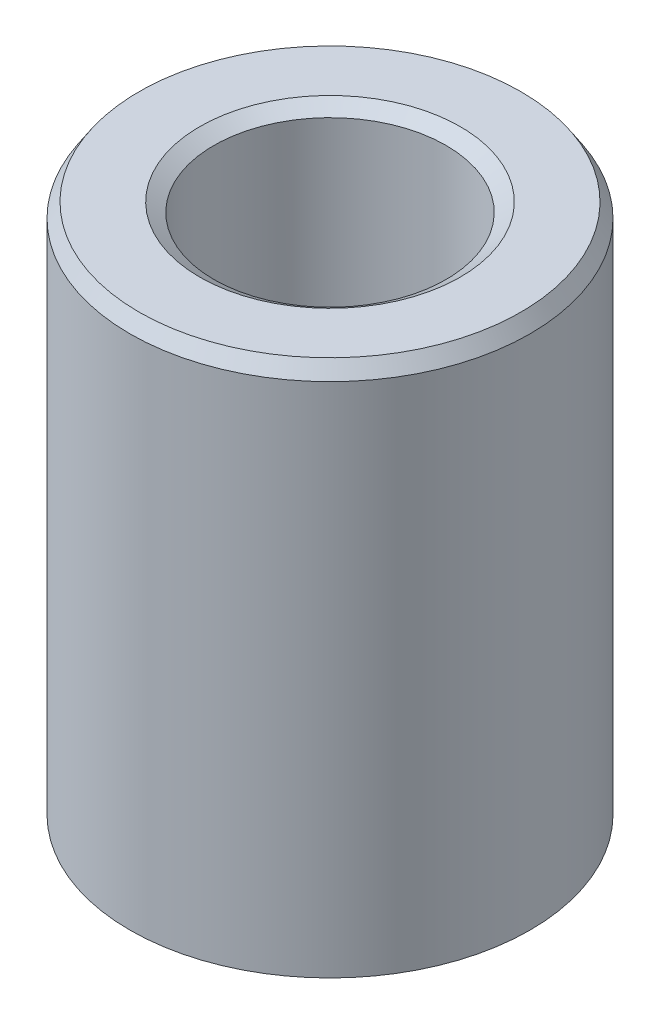
ISO-10303-21;
HEADER;
FILE_DESCRIPTION(('STEP AP214'),'2;1');
FILE_NAME('part.step','',(''),(''),'','','');
FILE_SCHEMA(('AUTOMOTIVE_DESIGN { 1 0 10303 214 1 1 1 1 }'));
ENDSEC;
DATA;
#1=APPLICATION_CONTEXT('core data for automotive mechanical design processes');
#2=APPLICATION_PROTOCOL_DEFINITION('international standard','automotive_design',2000,#1);
#3=PRODUCT_CONTEXT('',#1,'mechanical');
#4=PRODUCT('Part','Part','',(#3));
#5=PRODUCT_RELATED_PRODUCT_CATEGORY('part','',(#4));
#6=PRODUCT_DEFINITION_FORMATION('','',#4);
#7=PRODUCT_DEFINITION_CONTEXT('part definition',#1,'design');
#8=PRODUCT_DEFINITION('design','',#6,#7);
#9=PRODUCT_DEFINITION_SHAPE('','',#8);
#10=(LENGTH_UNIT() NAMED_UNIT(*) SI_UNIT(.MILLI.,.METRE.));
#11=(NAMED_UNIT(*) PLANE_ANGLE_UNIT() SI_UNIT($,.RADIAN.));
#12=(NAMED_UNIT(*) SI_UNIT($,.STERADIAN.) SOLID_ANGLE_UNIT());
#13=UNCERTAINTY_MEASURE_WITH_UNIT(LENGTH_MEASURE(1.E-05),#10,'distance_accuracy_value','');
#14=(GEOMETRIC_REPRESENTATION_CONTEXT(3) GLOBAL_UNCERTAINTY_ASSIGNED_CONTEXT((#13)) GLOBAL_UNIT_ASSIGNED_CONTEXT((#10,
#11,#12)) REPRESENTATION_CONTEXT('',''));
#15=CARTESIAN_POINT('',(0.,0.,0.));
#16=DIRECTION('',(0.,0.,1.));
#17=DIRECTION('',(1.,0.,0.));
#18=AXIS2_PLACEMENT_3D('',#15,#16,#17);
#19=CARTESIAN_POINT('',(0.,128.129675056822,0.));
#20=DIRECTION('',(0.,-1.,0.));
#21=DIRECTION('',(0.,0.,-1.));
#22=AXIS2_PLACEMENT_3D('',#19,#20,#21);
#23=CYLINDRICAL_SURFACE('',#22,47.5);
#24=CARTESIAN_POINT('',(0.,2.17447413861541,0.));
#25=DIRECTION('',(0.,1.,0.));
#26=DIRECTION('',(0.,0.,1.));
#27=AXIS2_PLACEMENT_3D('',#24,#25,#26);
#28=CIRCLE('',#27,47.5);
#29=CARTESIAN_POINT('',(0.,2.17447413861541,47.5));
#30=VERTEX_POINT('',#29);
#31=EDGE_CURVE('E10',#30,#30,#28,.T.);
#32=ORIENTED_EDGE('',*,*,#31,.T.);
#33=EDGE_LOOP('',(#32));
#34=FACE_BOUND('',#33,.T.);
#35=CARTESIAN_POINT('',(0.,124.757350152276,0.));
#36=DIRECTION('',(0.,1.,0.));
#37=DIRECTION('',(0.,0.,1.));
#38=AXIS2_PLACEMENT_3D('',#35,#36,#37);
#39=CIRCLE('',#38,47.5);
#40=CARTESIAN_POINT('',(0.,124.757350152276,47.5));
#41=VERTEX_POINT('',#40);
#42=EDGE_CURVE('E50',#41,#41,#39,.F.);
#43=ORIENTED_EDGE('',*,*,#42,.T.);
#44=EDGE_LOOP('',(#43));
#45=FACE_BOUND('',#44,.T.);
#46=ADVANCED_FACE('F39',(#34,#45),#23,.T.);
#47=CARTESIAN_POINT('',(0.,128.129675056822,0.));
#48=DIRECTION('',(0.,1.,0.));
#49=DIRECTION('',(0.,0.,1.));
#50=AXIS2_PLACEMENT_3D('',#47,#48,#49);
#51=PLANE('',#50);
#52=CARTESIAN_POINT('',(0.,128.129675056822,0.));
#53=DIRECTION('',(0.,1.,0.));
#54=DIRECTION('',(0.,0.,1.));
#55=AXIS2_PLACEMENT_3D('',#52,#53,#54);
#56=CIRCLE('',#55,30.9391969328806);
#57=CARTESIAN_POINT('',(0.,128.129675056822,30.9391969328806));
#58=VERTEX_POINT('',#57);
#59=EDGE_CURVE('E58',#58,#58,#56,.F.);
#60=ORIENTED_EDGE('',*,*,#59,.T.);
#61=EDGE_LOOP('',(#60));
#62=FACE_BOUND('',#61,.T.);
#63=CARTESIAN_POINT('',(0.,128.129675056822,0.));
#64=DIRECTION('',(0.,1.,0.));
#65=DIRECTION('',(0.,0.,1.));
#66=AXIS2_PLACEMENT_3D('',#63,#64,#65);
#67=CIRCLE('',#66,45.3255258613846);
#68=CARTESIAN_POINT('',(0.,128.129675056822,45.3255258613846));
#69=VERTEX_POINT('',#68);
#70=EDGE_CURVE('E61',#69,#69,#67,.T.);
#71=ORIENTED_EDGE('',*,*,#70,.T.);
#72=EDGE_LOOP('',(#71));
#73=FACE_BOUND('',#72,.T.);
#74=ADVANCED_FACE('F88',(#62,#73),#51,.T.);
#75=CARTESIAN_POINT('',(0.,0.,0.));
#76=DIRECTION('',(0.,1.,0.));
#77=DIRECTION('',(0.,0.,1.));
#78=AXIS2_PLACEMENT_3D('',#75,#76,#77);
#79=PLANE('',#78);
#80=CARTESIAN_POINT('',(0.,0.,0.));
#81=DIRECTION('',(0.,1.,0.));
#82=DIRECTION('',(0.,0.,1.));
#83=AXIS2_PLACEMENT_3D('',#80,#81,#82);
#84=CIRCLE('',#83,29.7413461669496);
#85=CARTESIAN_POINT('',(0.,0.,-29.7413461669496));
#86=VERTEX_POINT('',#85);
#87=EDGE_CURVE('E51',#86,#86,#84,.T.);
#88=ORIENTED_EDGE('',*,*,#87,.T.);
#89=EDGE_LOOP('',(#88));
#90=FACE_BOUND('',#89,.T.);
#91=CARTESIAN_POINT('',(0.,0.,0.));
#92=DIRECTION('',(0.,1.,0.));
#93=DIRECTION('',(0.,0.,1.));
#94=AXIS2_PLACEMENT_3D('',#91,#92,#93);
#95=CIRCLE('',#94,44.1276750954537);
#96=CARTESIAN_POINT('',(0.,0.,44.1276750954537));
#97=VERTEX_POINT('',#96);
#98=EDGE_CURVE('E54',#97,#97,#95,.F.);
#99=ORIENTED_EDGE('',*,*,#98,.T.);
#100=EDGE_LOOP('',(#99));
#101=FACE_BOUND('',#100,.T.);
#102=ADVANCED_FACE('F83',(#90,#101),#79,.F.);
#103=CARTESIAN_POINT('',(0.,128.129675056822,0.));
#104=DIRECTION('',(0.,-1.,0.));
#105=DIRECTION('',(0.,0.,-1.));
#106=AXIS2_PLACEMENT_3D('',#103,#104,#105);
#107=CYLINDRICAL_SURFACE('',#106,27.5668720283342);
#108=CARTESIAN_POINT('',(0.,125.955200918207,0.));
#109=DIRECTION('',(0.,1.,0.));
#110=DIRECTION('',(0.,0.,1.));
#111=AXIS2_PLACEMENT_3D('',#108,#109,#110);
#112=CIRCLE('',#111,27.5668720283342);
#113=CARTESIAN_POINT('',(0.,125.955200918207,27.5668720283342));
#114=VERTEX_POINT('',#113);
#115=EDGE_CURVE('E67',#114,#114,#112,.T.);
#116=ORIENTED_EDGE('',*,*,#115,.T.);
#117=EDGE_LOOP('',(#116));
#118=FACE_BOUND('',#117,.T.);
#119=CARTESIAN_POINT('',(0.,3.37232490454638,0.));
#120=DIRECTION('',(0.,1.,0.));
#121=DIRECTION('',(0.,0.,1.));
#122=AXIS2_PLACEMENT_3D('',#119,#120,#121);
#123=CIRCLE('',#122,27.5668720283342);
#124=CARTESIAN_POINT('',(0.,3.37232490454638,-27.5668720283342));
#125=VERTEX_POINT('',#124);
#126=EDGE_CURVE('E69',#125,#125,#123,.F.);
#127=ORIENTED_EDGE('',*,*,#126,.T.);
#128=EDGE_LOOP('',(#127));
#129=FACE_BOUND('',#128,.T.);
#130=ADVANCED_FACE('F71',(#118,#129),#107,.F.);
#131=CARTESIAN_POINT('',(0.,125.955200918207,0.));
#132=DIRECTION('',(0.,1.,0.));
#133=DIRECTION('',(0.,0.,1.));
#134=AXIS2_PLACEMENT_3D('',#131,#132,#133);
#135=CONICAL_SURFACE('',#134,27.5668720283342,0.998085533470509);
#136=ORIENTED_EDGE('',*,*,#59,.F.);
#137=EDGE_LOOP('',(#136));
#138=FACE_BOUND('',#137,.T.);
#139=ORIENTED_EDGE('',*,*,#115,.F.);
#140=EDGE_LOOP('',(#139));
#141=FACE_BOUND('',#140,.T.);
#142=ADVANCED_FACE('F77',(#138,#141),#135,.F.);
#143=CARTESIAN_POINT('',(0.,0.,0.));
#144=DIRECTION('',(0.,-1.,0.));
#145=DIRECTION('',(0.,0.,-1.));
#146=AXIS2_PLACEMENT_3D('',#143,#144,#145);
#147=CONICAL_SURFACE('',#146,29.7413461669496,0.572710793324381);
#148=CARTESIAN_POINT('',(0.,3.37232490454638,-27.5668720283342));
#149=CARTESIAN_POINT('',(0.,3.33719652012402,-27.5895228006114));
#150=CARTESIAN_POINT('',(0.,3.30206813570166,-27.6121735728886));
#151=CARTESIAN_POINT('',(0.,3.23181136685695,-27.6574751174431));
#152=CARTESIAN_POINT('',(0.,3.19668298243459,-27.6801258897204));
#153=CARTESIAN_POINT('',(0.,3.12642621358987,-27.7254274342749));
#154=CARTESIAN_POINT('',(0.,3.09129782916751,-27.7480782065521));
#155=CARTESIAN_POINT('',(0.,3.0210410603228,-27.7933797511066));
#156=CARTESIAN_POINT('',(0.,2.98591267590044,-27.8160305233838));
#157=CARTESIAN_POINT('',(0.,2.91565590705572,-27.8613320679383));
#158=CARTESIAN_POINT('',(0.,2.88052752263336,-27.8839828402156));
#159=CARTESIAN_POINT('',(0.,2.81027075378865,-27.9292843847701));
#160=CARTESIAN_POINT('',(0.,2.77514236936629,-27.9519351570473));
#161=CARTESIAN_POINT('',(0.,2.70488560052157,-27.9972367016018));
#162=CARTESIAN_POINT('',(0.,2.66975721609922,-28.019887473879));
#163=CARTESIAN_POINT('',(0.,2.5995004472545,-28.0651890184335));
#164=CARTESIAN_POINT('',(0.,2.56437206283214,-28.0878397907108));
#165=CARTESIAN_POINT('',(0.,2.49411529398742,-28.1331413352653));
#166=CARTESIAN_POINT('',(0.,2.45898690956507,-28.1557921075425));
#167=CARTESIAN_POINT('',(0.,2.38873014072035,-28.201093652097));
#168=CARTESIAN_POINT('',(0.,2.35360175629799,-28.2237444243742));
#169=CARTESIAN_POINT('',(0.,2.28334498745328,-28.2690459689287));
#170=CARTESIAN_POINT('',(0.,2.24821660303092,-28.291696741206));
#171=CARTESIAN_POINT('',(0.,2.1779598341862,-28.3369982857605));
#172=CARTESIAN_POINT('',(0.,2.14283144976384,-28.3596490580377));
#173=CARTESIAN_POINT('',(0.,2.07257468091913,-28.4049506025922));
#174=CARTESIAN_POINT('',(0.,2.03744629649677,-28.4276013748694));
#175=CARTESIAN_POINT('',(0.,1.96718952765205,-28.4729029194239));
#176=CARTESIAN_POINT('',(0.,1.9320611432297,-28.4955536917012));
#177=CARTESIAN_POINT('',(0.,1.86180437438498,-28.5408552362557));
#178=CARTESIAN_POINT('',(0.,1.82667598996262,-28.5635060085329));
#179=CARTESIAN_POINT('',(0.,1.75641922111791,-28.6088075530874));
#180=CARTESIAN_POINT('',(0.,1.72129083669555,-28.6314583253646));
#181=CARTESIAN_POINT('',(0.,1.65103406785083,-28.6767598699191));
#182=CARTESIAN_POINT('',(0.,1.61590568342847,-28.6994106421964));
#183=CARTESIAN_POINT('',(0.,1.54564891458376,-28.7447121867508));
#184=CARTESIAN_POINT('',(0.,1.5105205301614,-28.7673629590281));
#185=CARTESIAN_POINT('',(0.,1.44026376131668,-28.8126645035826));
#186=CARTESIAN_POINT('',(0.,1.40513537689432,-28.8353152758598));
#187=CARTESIAN_POINT('',(0.,1.33487860804961,-28.8806168204143));
#188=CARTESIAN_POINT('',(0.,1.29975022362725,-28.9032675926916));
#189=CARTESIAN_POINT('',(0.,1.22949345478253,-28.948569137246));
#190=CARTESIAN_POINT('',(0.,1.19436507036018,-28.9712199095233));
#191=CARTESIAN_POINT('',(0.,1.12410830151546,-29.0165214540778));
#192=CARTESIAN_POINT('',(0.,1.0889799170931,-29.039172226355));
#193=CARTESIAN_POINT('',(0.,1.01872314824838,-29.0844737709095));
#194=CARTESIAN_POINT('',(0.,0.983594763826027,-29.1071245431867));
#195=CARTESIAN_POINT('',(0.,0.913337994981311,-29.1524260877412));
#196=CARTESIAN_POINT('',(0.,0.878209610558953,-29.1750768600185));
#197=CARTESIAN_POINT('',(0.,0.807952841714236,-29.220378404573));
#198=CARTESIAN_POINT('',(0.,0.772824457291878,-29.2430291768502));
#199=CARTESIAN_POINT('',(0.,0.702567688447162,-29.2883307214047));
#200=CARTESIAN_POINT('',(0.,0.667439304024804,-29.3109814936819));
#201=CARTESIAN_POINT('',(0.,0.597182535180088,-29.3562830382364));
#202=CARTESIAN_POINT('',(0.,0.56205415075773,-29.3789338105137));
#203=CARTESIAN_POINT('',(0.,0.491797381913013,-29.4242353550682));
#204=CARTESIAN_POINT('',(0.,0.456668997490655,-29.4468861273454));
#205=CARTESIAN_POINT('',(0.,0.386412228645939,-29.4921876718999));
#206=CARTESIAN_POINT('',(0.,0.351283844223581,-29.5148384441771));
#207=CARTESIAN_POINT('',(0.,0.281027075378865,-29.5601399887316));
#208=CARTESIAN_POINT('',(0.,0.245898690956507,-29.5827907610089));
#209=CARTESIAN_POINT('',(0.,0.17564192211179,-29.6280923055634));
#210=CARTESIAN_POINT('',(0.,0.140513537689432,-29.6507430778406));
#211=CARTESIAN_POINT('',(0.,0.0702567688447168,-29.6960446223951));
#212=CARTESIAN_POINT('',(0.,0.0351283844223589,-29.7186953946723));
#213=CARTESIAN_POINT('',(0.,0.,-29.7413461669496));
#214=B_SPLINE_CURVE_WITH_KNOTS('',3,(#148,#149,#150,#151,#152,#153,#154,#155,#156,#157,#158,
#159,#160,#161,#162,#163,#164,#165,#166,#167,#168,#169,#170,#171,#172,#173,#174,#175,#176,#177,
#178,#179,#180,#181,#182,#183,#184,#185,#186,#187,#188,#189,#190,#191,#192,#193,#194,#195,#196,
#197,#198,#199,#200,#201,#202,#203,#204,#205,#206,#207,#208,#209,#210,#211,#212,#213),
.UNSPECIFIED.,.F.,.F.,(4,2,2,2,2,2,2,2,2,2,2,2,2,2,2,2,2,2,2,2,2,2,2,2,2,2,2,2,2,2,2,2,4),(0.,
0.12539357197211,0.250787143944221,0.376180715916331,0.50157428788844,0.626967859860552,
0.752361431832662,0.877755003804773,1.00314857577688,1.12854214774899,1.2539357197211,
1.37932929169321,1.50472286366532,1.63011643563743,1.75551000760954,1.88090357958166,
2.00629715155377,2.13169072352587,2.25708429549799,2.3824778674701,2.50787143944221,
2.63326501141432,2.75865858338643,2.88405215535854,3.00944572733065,3.13483929930276,
3.26023287127487,3.38562644324698,3.51102001521909,3.6364135871912,3.76180715916331,
3.88720073113542,4.01259430310753),.UNSPECIFIED.);
#215=EDGE_CURVE('BSEAM73',#125,#86,#214,.T.);
#216=ORIENTED_EDGE('',*,*,#126,.F.);
#217=ORIENTED_EDGE('',*,*,#87,.F.);
#218=ORIENTED_EDGE('',*,*,#215,.T.);
#219=ORIENTED_EDGE('',*,*,#215,.F.);
#220=EDGE_LOOP('',(#216,#218,#217,#219));
#221=FACE_BOUND('',#220,.T.);
#222=ADVANCED_FACE('F73',(#221),#147,.F.);
#223=CARTESIAN_POINT('',(0.,2.17447413861541,0.));
#224=DIRECTION('',(0.,1.,0.));
#225=DIRECTION('',(0.,0.,1.));
#226=AXIS2_PLACEMENT_3D('',#223,#224,#225);
#227=CONICAL_SURFACE('',#226,47.5,0.998085533470512);
#228=ORIENTED_EDGE('',*,*,#98,.F.);
#229=EDGE_LOOP('',(#228));
#230=FACE_BOUND('',#229,.T.);
#231=ORIENTED_EDGE('',*,*,#31,.F.);
#232=EDGE_LOOP('',(#231));
#233=FACE_BOUND('',#232,.T.);
#234=ADVANCED_FACE('F76',(#230,#233),#227,.T.);
#235=CARTESIAN_POINT('',(0.,128.129675056822,0.));
#236=DIRECTION('',(0.,-1.,0.));
#237=DIRECTION('',(0.,0.,-1.));
#238=AXIS2_PLACEMENT_3D('',#235,#236,#237);
#239=CONICAL_SURFACE('',#238,45.3255258613846,0.572710793324385);
#240=ORIENTED_EDGE('',*,*,#42,.F.);
#241=EDGE_LOOP('',(#240));
#242=FACE_BOUND('',#241,.T.);
#243=ORIENTED_EDGE('',*,*,#70,.F.);
#244=EDGE_LOOP('',(#243));
#245=FACE_BOUND('',#244,.T.);
#246=ADVANCED_FACE('F45',(#242,#245),#239,.T.);
#247=CLOSED_SHELL('',(#46,#74,#102,#130,#142,#222,#234,#246));
#248=MANIFOLD_SOLID_BREP('B2',#247);
#249=ADVANCED_BREP_SHAPE_REPRESENTATION('',(#18,#248),#14);
#250=SHAPE_DEFINITION_REPRESENTATION(#9,#249);
ENDSEC;
END-ISO-10303-21;
